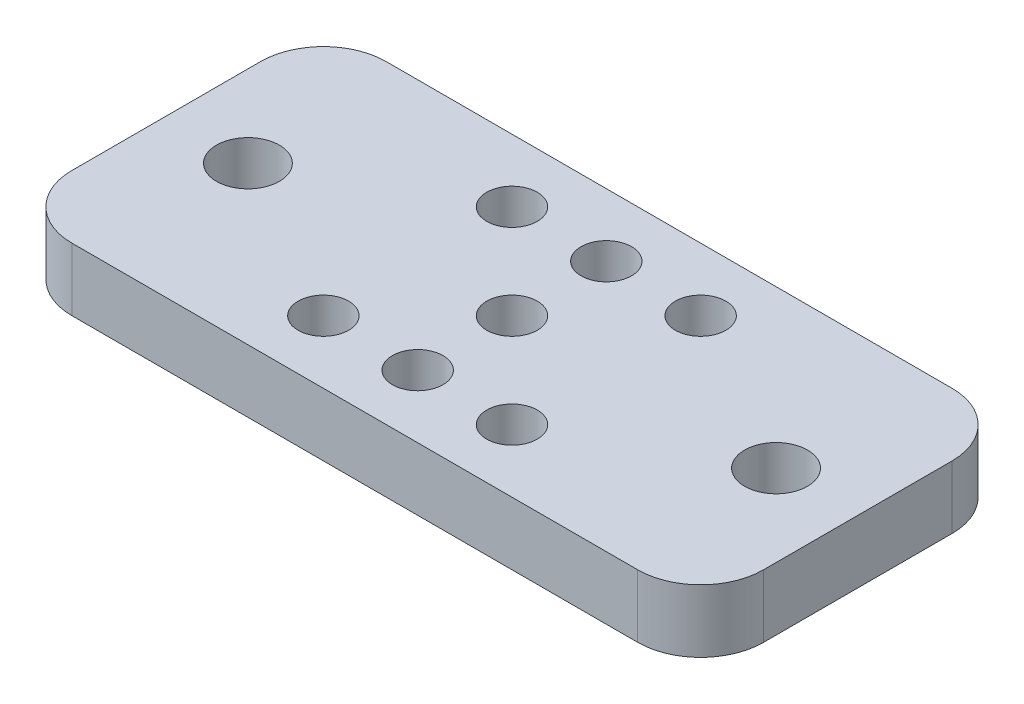
ISO-10303-21;
HEADER;
FILE_DESCRIPTION(('STEP AP214'),'2;1');
FILE_NAME('part.step','',(''),(''),'','','');
FILE_SCHEMA(('AUTOMOTIVE_DESIGN { 1 0 10303 214 1 1 1 1 }'));
ENDSEC;
DATA;
#1=APPLICATION_CONTEXT('core data for automotive mechanical design processes');
#2=APPLICATION_PROTOCOL_DEFINITION('international standard','automotive_design',2000,#1);
#3=PRODUCT_CONTEXT('',#1,'mechanical');
#4=PRODUCT('Part','Part','',(#3));
#5=PRODUCT_RELATED_PRODUCT_CATEGORY('part','',(#4));
#6=PRODUCT_DEFINITION_FORMATION('','',#4);
#7=PRODUCT_DEFINITION_CONTEXT('part definition',#1,'design');
#8=PRODUCT_DEFINITION('design','',#6,#7);
#9=PRODUCT_DEFINITION_SHAPE('','',#8);
#10=(LENGTH_UNIT() NAMED_UNIT(*) SI_UNIT(.MILLI.,.METRE.));
#11=(NAMED_UNIT(*) PLANE_ANGLE_UNIT() SI_UNIT($,.RADIAN.));
#12=(NAMED_UNIT(*) SI_UNIT($,.STERADIAN.) SOLID_ANGLE_UNIT());
#13=UNCERTAINTY_MEASURE_WITH_UNIT(LENGTH_MEASURE(1.E-05),#10,'distance_accuracy_value','');
#14=(GEOMETRIC_REPRESENTATION_CONTEXT(3) GLOBAL_UNCERTAINTY_ASSIGNED_CONTEXT((#13)) GLOBAL_UNIT_ASSIGNED_CONTEXT((#10,
#11,#12)) REPRESENTATION_CONTEXT('',''));
#15=CARTESIAN_POINT('',(0.,0.,0.));
#16=DIRECTION('',(0.,0.,1.));
#17=DIRECTION('',(1.,0.,0.));
#18=AXIS2_PLACEMENT_3D('',#15,#16,#17);
#19=CARTESIAN_POINT('',(0.,0.,0.));
#20=DIRECTION('',(0.,-1.,0.));
#21=DIRECTION('',(0.,0.,-1.));
#22=AXIS2_PLACEMENT_3D('',#19,#20,#21);
#23=CONICAL_SURFACE('',#22,4.88949999999022,0.872664625993706);
#24=CARTESIAN_POINT('',(0.,1.96080801813507,0.));
#25=DIRECTION('',(0.,-1.,0.));
#26=DIRECTION('',(0.,0.,-1.));
#27=AXIS2_PLACEMENT_3D('',#24,#25,#26);
#28=CIRCLE('',#27,2.55269999999999);
#29=CARTESIAN_POINT('',(0.,1.96080801813507,-2.55269999999999));
#30=VERTEX_POINT('',#29);
#31=EDGE_CURVE('E335',#30,#30,#28,.F.);
#32=ORIENTED_EDGE('',*,*,#31,.T.);
#33=EDGE_LOOP('',(#32));
#34=FACE_BOUND('',#33,.T.);
#35=CARTESIAN_POINT('',(0.,0.,0.));
#36=DIRECTION('',(0.,-1.,0.));
#37=DIRECTION('',(0.,0.,-1.));
#38=AXIS2_PLACEMENT_3D('',#35,#36,#37);
#39=CIRCLE('',#38,4.88949999999022);
#40=CARTESIAN_POINT('',(-1.10716033156425,-1.09044013382332E-11,-4.7625000000282));
#41=VERTEX_POINT('',#40);
#42=CARTESIAN_POINT('',(-1.1071603316559,-1.25566453852119E-11,4.76250000000612));
#43=VERTEX_POINT('',#42);
#44=EDGE_CURVE('E173',#41,#43,#39,.F.);
#45=ORIENTED_EDGE('',*,*,#44,.F.);
#46=CARTESIAN_POINT('',(-1.10716033164571,-2.63822423020211E-11,-4.76250000002541));
#47=CARTESIAN_POINT('',(-1.01556584799401,0.0174143321050501,-4.76250000002514));
#48=CARTESIAN_POINT('',(-0.923581742971783,0.0328322372802188,-4.7625000000249));
#49=CARTESIAN_POINT('',(-0.738988898880255,0.0594598202825174,-4.7625000000245));
#50=CARTESIAN_POINT('',(-0.646380037194878,0.0706686460317048,-4.76250000002433));
#51=CARTESIAN_POINT('',(-0.461577601938212,0.0885733038527393,-4.76250000002406));
#52=CARTESIAN_POINT('',(-0.369387964817245,0.0953094337230892,-4.76250000002396));
#53=CARTESIAN_POINT('',(-0.184798870483565,0.104305383924043,-4.76250000002383));
#54=CARTESIAN_POINT('',(-0.0923994352417823,0.106565653132093,-4.76250000002379));
#55=CARTESIAN_POINT('',(0.0923994352417823,0.106565653132093,-4.76250000002379));
#56=CARTESIAN_POINT('',(0.184798870483565,0.104305383924043,-4.76250000002383));
#57=CARTESIAN_POINT('',(0.369387964817244,0.0953094337230892,-4.76250000002396));
#58=CARTESIAN_POINT('',(0.461577601938212,0.0885733038527391,-4.76250000002406));
#59=CARTESIAN_POINT('',(0.646380037194877,0.070668646031705,-4.76250000002433));
#60=CARTESIAN_POINT('',(0.738988898880255,0.0594598202825179,-4.7625000000245));
#61=CARTESIAN_POINT('',(0.923581742971783,0.0328322372802197,-4.7625000000249));
#62=CARTESIAN_POINT('',(1.01556584799401,0.0174143321050511,-4.76250000002514));
#63=CARTESIAN_POINT('',(1.10716033164571,-2.63814861267324E-11,-4.76250000002541));
#64=B_SPLINE_CURVE_WITH_KNOTS('',3,(#46,#47,#48,#49,#50,#51,#52,#53,#54,#55,#56,#57,#58,#59,#60,
#61,#62,#63),.UNSPECIFIED.,.F.,.F.,(4,2,2,2,2,2,2,2,4),(0.,0.27969841270787,0.559453416538992,
0.836652406596292,1.11382359536863,1.39099478414097,1.66819377419827,1.94794877802939,
2.22764719073726),.UNSPECIFIED.);
#65=CARTESIAN_POINT('',(1.10716033156995,2.28653176471438E-12,-4.76250000001074));
#66=VERTEX_POINT('',#65);
#67=EDGE_CURVE('E168',#41,#66,#64,.T.);
#68=ORIENTED_EDGE('',*,*,#67,.T.);
#69=CARTESIAN_POINT('',(0.,0.,0.));
#70=DIRECTION('',(0.,-1.,0.));
#71=DIRECTION('',(0.,0.,-1.));
#72=AXIS2_PLACEMENT_3D('',#69,#70,#71);
#73=CIRCLE('',#72,4.88949999999022);
#74=CARTESIAN_POINT('',(1.10716033163934,-2.21943016249676E-11,4.76250000000997));
#75=VERTEX_POINT('',#74);
#76=EDGE_CURVE('E192',#75,#66,#73,.F.);
#77=ORIENTED_EDGE('',*,*,#76,.F.);
#78=CARTESIAN_POINT('',(1.1071603316573,-1.14571308680346E-11,4.76250000002176));
#79=CARTESIAN_POINT('',(1.01556584800349,0.0174143321113151,4.76250000002167));
#80=CARTESIAN_POINT('',(0.923581742980016,0.0328322372829986,4.76250000002159));
#81=CARTESIAN_POINT('',(0.738988898886656,0.0594598202828888,4.76250000002145));
#82=CARTESIAN_POINT('',(0.64638003720069,0.0706686460331491,4.76250000002139));
#83=CARTESIAN_POINT('',(0.461577601942521,0.0885733038550703,4.76250000002129));
#84=CARTESIAN_POINT('',(0.369387964820638,0.0953094337252397,4.76250000002126));
#85=CARTESIAN_POINT('',(0.184798870485221,0.104305383926103,4.76250000002121));
#86=CARTESIAN_POINT('',(0.0923994352426152,0.106565653134245,4.7625000000212));
#87=CARTESIAN_POINT('',(-0.0923994352427852,0.106565653134295,4.7625000000212));
#88=CARTESIAN_POINT('',(-0.18479887048558,0.104305383926195,4.76250000002121));
#89=CARTESIAN_POINT('',(-0.369387964821306,0.0953094337250975,4.76250000002126));
#90=CARTESIAN_POINT('',(-0.461577601943305,0.0885733038546535,4.76250000002129));
#91=CARTESIAN_POINT('',(-0.646380037201938,0.0706686460333712,4.76250000002139));
#92=CARTESIAN_POINT('',(-0.738988898888251,0.0594598202840341,4.76250000002145));
#93=CARTESIAN_POINT('',(-0.9235817429816,0.0328322372813932,4.76250000002159));
#94=CARTESIAN_POINT('',(-1.01556584800471,0.0174143321060337,4.76250000002167));
#95=CARTESIAN_POINT('',(-1.10716033165729,-2.56067399236779E-11,4.76250000002176));
#96=B_SPLINE_CURVE_WITH_KNOTS('',3,(#78,#79,#80,#81,#82,#83,#84,#85,#86,#87,#88,#89,#90,#91,#92,
#93,#94,#95),.UNSPECIFIED.,.F.,.F.,(4,2,2,2,2,2,2,2,4),(0.,0.279698412709825,0.559453416543218,
0.836652406603142,1.11382359537798,1.39099478415335,1.66819377421376,1.94794877804772,
2.2276471907583),.UNSPECIFIED.);
#97=EDGE_CURVE('E195',#75,#43,#96,.T.);
#98=ORIENTED_EDGE('',*,*,#97,.T.);
#99=EDGE_LOOP('',(#45,#68,#77,#98));
#100=FACE_BOUND('',#99,.T.);
#101=ADVANCED_FACE('F18',(#34,#100),#23,.F.);
#102=CARTESIAN_POINT('',(-9.525,5.6843418860808E-11,-9.525));
#103=DIRECTION('',(0.,-1.,0.));
#104=DIRECTION('',(0.,0.,-1.));
#105=AXIS2_PLACEMENT_3D('',#102,#103,#104);
#106=CONICAL_SURFACE('',#105,4.88949999987299,0.872664625986321);
#107=CARTESIAN_POINT('',(-9.525,1.96080801813507,-9.525));
#108=DIRECTION('',(0.,-1.,0.));
#109=DIRECTION('',(0.,0.,-1.));
#110=AXIS2_PLACEMENT_3D('',#107,#108,#109);
#111=CIRCLE('',#110,2.5527);
#112=CARTESIAN_POINT('',(-9.525,1.96080801813507,-12.0777));
#113=VERTEX_POINT('',#112);
#114=EDGE_CURVE('E337',#113,#113,#111,.F.);
#115=ORIENTED_EDGE('',*,*,#114,.T.);
#116=EDGE_LOOP('',(#115));
#117=FACE_BOUND('',#116,.T.);
#118=CARTESIAN_POINT('',(-9.525,6.16941313865913E-12,-9.525));
#119=DIRECTION('',(0.,-1.,0.));
#120=DIRECTION('',(0.,0.,-1.));
#121=AXIS2_PLACEMENT_3D('',#118,#119,#120);
#122=CIRCLE('',#121,4.88949999993338);
#123=CARTESIAN_POINT('',(-4.76250000000091,-1.91675380038478E-11,-10.6321603314985));
#124=VERTEX_POINT('',#123);
#125=CARTESIAN_POINT('',(-4.76250000003153,6.91359161869413E-12,-8.41783966849924));
#126=VERTEX_POINT('',#125);
#127=EDGE_CURVE('E150',#124,#126,#122,.F.);
#128=ORIENTED_EDGE('',*,*,#127,.F.);
#129=CARTESIAN_POINT('',(-4.7625,-4.59927771143662E-11,-10.6321603316396));
#130=CARTESIAN_POINT('',(-4.7625,0.0155579821146269,-10.5502934896204));
#131=CARTESIAN_POINT('',(-4.7625,0.0295282546617635,-10.4681299239067));
#132=CARTESIAN_POINT('',(-4.7625,0.0541269200994477,-10.3032921767551));
#133=CARTESIAN_POINT('',(-4.7625,0.0647547989670441,-10.2206179187698));
#134=CARTESIAN_POINT('',(-4.7625,0.0913695885131721,-9.97198203324816));
#135=CARTESIAN_POINT('',(-4.7625,0.102085872783814,-9.80541647975679));
#136=CARTESIAN_POINT('',(-4.7625,0.108715690096151,-9.47459587933086));
#137=CARTESIAN_POINT('',(-4.7625,0.104855890285284,-9.31034499733994));
#138=CARTESIAN_POINT('',(-4.7625,0.0830884700253322,-8.98287373706836));
#139=CARTESIAN_POINT('',(-4.7625,0.0651904806638021,-8.81965272958963));
#140=CARTESIAN_POINT('',(-4.7625,0.0347884249721777,-8.61744596602856));
#141=CARTESIAN_POINT('',(-4.7625,0.0283747411759618,-8.57747962973176));
#142=CARTESIAN_POINT('',(-4.7625,0.0147663723539465,-8.4975994598446));
#143=CARTESIAN_POINT('',(-4.7625,0.00757018111473189,-8.45768588271908));
#144=CARTESIAN_POINT('',(-4.7625,-4.59933024588265E-11,-8.41783966836035));
#145=B_SPLINE_CURVE_WITH_KNOTS('',3,(#129,#130,#131,#132,#133,#134,#135,#136,#137,#138,#139,
#140,#141,#142,#143,#144),.UNSPECIFIED.,.F.,.F.,(4,2,2,2,2,2,2,4),(0.,0.249967186429478,
0.499972796253219,1.00001199741758,1.49230753344536,1.98426561865279,2.10569518268994,
2.22736276310113),.UNSPECIFIED.);
#146=EDGE_CURVE('E22',#124,#126,#145,.T.);
#147=ORIENTED_EDGE('',*,*,#146,.T.);
#148=EDGE_LOOP('',(#128,#147));
#149=FACE_BOUND('',#148,.T.);
#150=ADVANCED_FACE('F165',(#117,#149),#106,.F.);
#151=CARTESIAN_POINT('',(9.525,5.6843418860808E-11,-9.525));
#152=DIRECTION('',(0.,-1.,0.));
#153=DIRECTION('',(0.,0.,-1.));
#154=AXIS2_PLACEMENT_3D('',#151,#152,#153);
#155=CONICAL_SURFACE('',#154,4.88949999987299,0.872664625986321);
#156=CARTESIAN_POINT('',(9.525,1.96080801813507,-9.525));
#157=DIRECTION('',(0.,-1.,0.));
#158=DIRECTION('',(0.,0.,-1.));
#159=AXIS2_PLACEMENT_3D('',#156,#157,#158);
#160=CIRCLE('',#159,2.5527);
#161=CARTESIAN_POINT('',(9.525,1.96080801813507,-12.0777));
#162=VERTEX_POINT('',#161);
#163=EDGE_CURVE('E343',#162,#162,#160,.F.);
#164=ORIENTED_EDGE('',*,*,#163,.T.);
#165=EDGE_LOOP('',(#164));
#166=FACE_BOUND('',#165,.T.);
#167=CARTESIAN_POINT('',(9.525,6.16941313865913E-12,-9.525));
#168=DIRECTION('',(0.,-1.,0.));
#169=DIRECTION('',(0.,0.,-1.));
#170=AXIS2_PLACEMENT_3D('',#167,#168,#169);
#171=CIRCLE('',#170,4.88949999993338);
#172=CARTESIAN_POINT('',(4.7625,-1.84030050918551E-11,-8.41783966850557));
#173=VERTEX_POINT('',#172);
#174=CARTESIAN_POINT('',(4.76250000003153,6.91359161869413E-12,-10.6321603315008));
#175=VERTEX_POINT('',#174);
#176=EDGE_CURVE('E185',#173,#175,#171,.F.);
#177=ORIENTED_EDGE('',*,*,#176,.F.);
#178=CARTESIAN_POINT('',(4.7625,-4.59516161358119E-11,-8.41783966836058));
#179=CARTESIAN_POINT('',(4.7625,0.0155579821146646,-8.49970651037986));
#180=CARTESIAN_POINT('',(4.7625,0.0295282546617979,-8.58187007609351));
#181=CARTESIAN_POINT('',(4.7625,0.0541269200994759,-8.74670782324512));
#182=CARTESIAN_POINT('',(4.7625,0.0647547989670691,-8.82938208123037));
#183=CARTESIAN_POINT('',(4.7625,0.0913695885131876,-9.07801796675206));
#184=CARTESIAN_POINT('',(4.7625,0.102085872783823,-9.24458352024342));
#185=CARTESIAN_POINT('',(4.7625,0.108715690096147,-9.57540412066935));
#186=CARTESIAN_POINT('',(4.7625,0.104855890285275,-9.73965500266026));
#187=CARTESIAN_POINT('',(4.7625,0.083088470025312,-10.0671262629318));
#188=CARTESIAN_POINT('',(4.7625,0.0651904806637762,-10.2303472704106));
#189=CARTESIAN_POINT('',(4.7625,0.0347884249721518,-10.4325540339716));
#190=CARTESIAN_POINT('',(4.7625,0.0283747411759406,-10.4725203702684));
#191=CARTESIAN_POINT('',(4.7625,0.0147663723539357,-10.5524005401555));
#192=CARTESIAN_POINT('',(4.7625,0.00757018111472671,-10.5923141172809));
#193=CARTESIAN_POINT('',(4.7625,-4.59925801199573E-11,-10.6321603316396));
#194=B_SPLINE_CURVE_WITH_KNOTS('',3,(#178,#179,#180,#181,#182,#183,#184,#185,#186,#187,#188,
#189,#190,#191,#192,#193),.UNSPECIFIED.,.F.,.F.,(4,2,2,2,2,2,2,4),(0.,0.249967186429472,
0.499972796253209,1.00001199741756,1.49230753344533,1.98426561865275,2.1056951826898,
2.22736276310089),.UNSPECIFIED.);
#195=EDGE_CURVE('E225',#173,#175,#194,.T.);
#196=ORIENTED_EDGE('',*,*,#195,.T.);
#197=EDGE_LOOP('',(#177,#196));
#198=FACE_BOUND('',#197,.T.);
#199=ADVANCED_FACE('F237',(#166,#198),#155,.F.);
#200=CARTESIAN_POINT('',(9.525,5.6843418860808E-11,9.525));
#201=DIRECTION('',(0.,-1.,0.));
#202=DIRECTION('',(0.,0.,-1.));
#203=AXIS2_PLACEMENT_3D('',#200,#201,#202);
#204=CONICAL_SURFACE('',#203,4.88949999988008,0.872664625993706);
#205=CARTESIAN_POINT('',(9.525,1.96080801813507,9.525));
#206=DIRECTION('',(0.,-1.,0.));
#207=DIRECTION('',(0.,0.,-1.));
#208=AXIS2_PLACEMENT_3D('',#205,#206,#207);
#209=CIRCLE('',#208,2.5527);
#210=CARTESIAN_POINT('',(9.525,1.96080801813507,6.9723));
#211=VERTEX_POINT('',#210);
#212=EDGE_CURVE('E453',#211,#211,#209,.F.);
#213=ORIENTED_EDGE('',*,*,#212,.T.);
#214=EDGE_LOOP('',(#213));
#215=FACE_BOUND('',#214,.T.);
#216=CARTESIAN_POINT('',(9.525,-3.55729952158583E-11,9.525));
#217=DIRECTION('',(0.,-1.,0.));
#218=DIRECTION('',(0.,0.,-1.));
#219=AXIS2_PLACEMENT_3D('',#216,#217,#218);
#220=CIRCLE('',#219,4.88949999999022);
#221=CARTESIAN_POINT('',(4.76249999999909,-3.97749298917532E-11,10.6321603316383));
#222=VERTEX_POINT('',#221);
#223=CARTESIAN_POINT('',(4.76250000000568,-3.63175375973388E-11,8.41783966835945));
#224=VERTEX_POINT('',#223);
#225=EDGE_CURVE('E346',#222,#224,#220,.F.);
#226=ORIENTED_EDGE('',*,*,#225,.F.);
#227=CARTESIAN_POINT('',(4.7625,-4.24871205896211E-11,10.6321603316525));
#228=CARTESIAN_POINT('',(4.7625,0.0155579821183182,10.550293489632));
#229=CARTESIAN_POINT('',(4.7625,0.0295282546656159,10.468129923917));
#230=CARTESIAN_POINT('',(4.7625,0.0541269201035695,10.3032921767628));
#231=CARTESIAN_POINT('',(4.7625,0.0647547989712738,10.2206179187762));
#232=CARTESIAN_POINT('',(4.7625,0.0913695885176391,9.97198203325059));
#233=CARTESIAN_POINT('',(4.7625,0.102085872788324,9.8054164797566));
#234=CARTESIAN_POINT('',(4.7625,0.108715690100502,9.47459587932545));
#235=CARTESIAN_POINT('',(4.7625,0.104855890289436,9.31034499733194));
#236=CARTESIAN_POINT('',(4.7625,0.083088470028864,8.9828737370552));
#237=CARTESIAN_POINT('',(4.7625,0.065190480666913,8.81965272957392));
#238=CARTESIAN_POINT('',(4.7625,0.034788424974878,8.61744596601121));
#239=CARTESIAN_POINT('',(4.7625,0.0283747411787897,8.57747962971531));
#240=CARTESIAN_POINT('',(4.7625,0.0147663723570777,8.49759945982994));
#241=CARTESIAN_POINT('',(4.7625,0.00757018111803902,8.45768588270531));
#242=CARTESIAN_POINT('',(4.7625,-4.24871089386608E-11,8.41783966834747));
#243=B_SPLINE_CURVE_WITH_KNOTS('',3,(#227,#228,#229,#230,#231,#232,#233,#234,#235,#236,#237,
#238,#239,#240,#241,#242),.UNSPECIFIED.,.F.,.F.,(4,2,2,2,2,2,2,4),(0.,0.24996718643341,
0.499972796261085,1.00001199743331,1.49230753346886,1.98426561868406,2.10569518271849,
2.22736276312695),.UNSPECIFIED.);
#244=EDGE_CURVE('E202',#222,#224,#243,.T.);
#245=ORIENTED_EDGE('',*,*,#244,.T.);
#246=EDGE_LOOP('',(#226,#245));
#247=FACE_BOUND('',#246,.T.);
#248=ADVANCED_FACE('F233',(#215,#247),#204,.F.);
#249=CARTESIAN_POINT('',(-9.525,5.6843418860808E-11,9.525));
#250=DIRECTION('',(0.,-1.,0.));
#251=DIRECTION('',(0.,0.,-1.));
#252=AXIS2_PLACEMENT_3D('',#249,#250,#251);
#253=CONICAL_SURFACE('',#252,4.88949999988008,0.872664625993706);
#254=CARTESIAN_POINT('',(-9.525,1.96080801813507,9.525));
#255=DIRECTION('',(0.,-1.,0.));
#256=DIRECTION('',(0.,0.,-1.));
#257=AXIS2_PLACEMENT_3D('',#254,#255,#256);
#258=CIRCLE('',#257,2.5527);
#259=CARTESIAN_POINT('',(-9.525,1.96080801813507,6.9723));
#260=VERTEX_POINT('',#259);
#261=EDGE_CURVE('E455',#260,#260,#258,.F.);
#262=ORIENTED_EDGE('',*,*,#261,.T.);
#263=EDGE_LOOP('',(#262));
#264=FACE_BOUND('',#263,.T.);
#265=CARTESIAN_POINT('',(-9.525,-3.55744508216872E-11,9.525));
#266=DIRECTION('',(0.,-1.,0.));
#267=DIRECTION('',(0.,0.,-1.));
#268=AXIS2_PLACEMENT_3D('',#265,#266,#267);
#269=CIRCLE('',#268,4.88949999999022);
#270=CARTESIAN_POINT('',(-4.7625,-4.05403636950191E-11,8.41783966835772));
#271=VERTEX_POINT('',#270);
#272=CARTESIAN_POINT('',(-4.76250000000567,-3.63186293017105E-11,10.6321603316405));
#273=VERTEX_POINT('',#272);
#274=EDGE_CURVE('E435',#271,#273,#269,.F.);
#275=ORIENTED_EDGE('',*,*,#274,.F.);
#276=CARTESIAN_POINT('',(-4.7625,-4.25293521401065E-11,8.41783966834725));
#277=CARTESIAN_POINT('',(-4.7625,0.0155579821182793,8.49970651036783));
#278=CARTESIAN_POINT('',(-4.7625,0.0295282546655801,8.58187007608279));
#279=CARTESIAN_POINT('',(-4.7625,0.0541269201035399,8.74670782323702));
#280=CARTESIAN_POINT('',(-4.7625,0.0647547989712474,8.82938208122359));
#281=CARTESIAN_POINT('',(-4.7625,0.0913695885176218,9.07801796674921));
#282=CARTESIAN_POINT('',(-4.7625,0.102085872788313,9.2445835202432));
#283=CARTESIAN_POINT('',(-4.7625,0.108715690100503,9.57540412067436));
#284=CARTESIAN_POINT('',(-4.7625,0.104855890289442,9.73965500266787));
#285=CARTESIAN_POINT('',(-4.7625,0.0830884700288797,10.0671262629446));
#286=CARTESIAN_POINT('',(-4.7625,0.0651904806669328,10.2303472704259));
#287=CARTESIAN_POINT('',(-4.7625,0.0347884249749001,10.4325540339886));
#288=CARTESIAN_POINT('',(-4.7625,0.0283747411788084,10.4725203702846));
#289=CARTESIAN_POINT('',(-4.7625,0.0147663723570881,10.55240054017));
#290=CARTESIAN_POINT('',(-4.7625,0.00757018111804455,10.5923141172947));
#291=CARTESIAN_POINT('',(-4.7625,-4.24874784491326E-11,10.6321603316525));
#292=B_SPLINE_CURVE_WITH_KNOTS('',3,(#276,#277,#278,#279,#280,#281,#282,#283,#284,#285,#286,
#287,#288,#289,#290,#291),.UNSPECIFIED.,.F.,.F.,(4,2,2,2,2,2,2,4),(0.,0.249967186433415,
0.499972796261098,1.00001199743333,1.4923075334689,1.9842656186841,2.10569518271862,
2.22736276312717),.UNSPECIFIED.);
#293=EDGE_CURVE('E218',#271,#273,#292,.T.);
#294=ORIENTED_EDGE('',*,*,#293,.T.);
#295=EDGE_LOOP('',(#275,#294));
#296=FACE_BOUND('',#295,.T.);
#297=ADVANCED_FACE('F230',(#264,#296),#253,.F.);
#298=CARTESIAN_POINT('',(0.,5.6843418860808E-11,-9.525));
#299=DIRECTION('',(0.,-1.,0.));
#300=DIRECTION('',(0.,0.,-1.));
#301=AXIS2_PLACEMENT_3D('',#298,#299,#300);
#302=CONICAL_SURFACE('',#301,4.88949999987299,0.872664625986321);
#303=CARTESIAN_POINT('',(0.,1.96080801813507,-9.525));
#304=DIRECTION('',(0.,-1.,0.));
#305=DIRECTION('',(0.,0.,-1.));
#306=AXIS2_PLACEMENT_3D('',#303,#304,#305);
#307=CIRCLE('',#306,2.5527);
#308=CARTESIAN_POINT('',(0.,1.96080801813507,-12.0777));
#309=VERTEX_POINT('',#308);
#310=EDGE_CURVE('E466',#309,#309,#307,.F.);
#311=ORIENTED_EDGE('',*,*,#310,.T.);
#312=EDGE_LOOP('',(#311));
#313=FACE_BOUND('',#312,.T.);
#314=CARTESIAN_POINT('',(0.,6.16941313865913E-12,-9.525));
#315=DIRECTION('',(0.,-1.,0.));
#316=DIRECTION('',(0.,0.,-1.));
#317=AXIS2_PLACEMENT_3D('',#314,#315,#316);
#318=CIRCLE('',#317,4.88949999993338);
#319=EDGE_CURVE('E162',#175,#124,#318,.F.);
#320=ORIENTED_EDGE('',*,*,#319,.F.);
#321=ORIENTED_EDGE('',*,*,#195,.F.);
#322=CARTESIAN_POINT('',(0.,9.146127058798E-12,-9.525));
#323=DIRECTION('',(0.,-1.,0.));
#324=DIRECTION('',(0.,0.,-1.));
#325=AXIS2_PLACEMENT_3D('',#322,#323,#324);
#326=CIRCLE('',#325,4.88949999992983);
#327=EDGE_CURVE('E188',#66,#173,#326,.F.);
#328=ORIENTED_EDGE('',*,*,#327,.F.);
#329=ORIENTED_EDGE('',*,*,#67,.F.);
#330=CARTESIAN_POINT('',(0.,9.146127058798E-12,-9.525));
#331=DIRECTION('',(0.,-1.,0.));
#332=DIRECTION('',(0.,0.,-1.));
#333=AXIS2_PLACEMENT_3D('',#330,#331,#332);
#334=CIRCLE('',#333,4.88949999992983);
#335=EDGE_CURVE('E159',#126,#41,#334,.F.);
#336=ORIENTED_EDGE('',*,*,#335,.F.);
#337=ORIENTED_EDGE('',*,*,#146,.F.);
#338=EDGE_LOOP('',(#320,#321,#328,#329,#336,#337));
#339=FACE_BOUND('',#338,.T.);
#340=ADVANCED_FACE('F169',(#313,#339),#302,.F.);
#341=CARTESIAN_POINT('',(0.,5.6843418860808E-11,9.525));
#342=DIRECTION('',(0.,-1.,0.));
#343=DIRECTION('',(0.,0.,-1.));
#344=AXIS2_PLACEMENT_3D('',#341,#342,#343);
#345=CONICAL_SURFACE('',#344,4.88949999988008,0.872664625993706);
#346=CARTESIAN_POINT('',(0.,1.96080801813507,9.525));
#347=DIRECTION('',(0.,-1.,0.));
#348=DIRECTION('',(0.,0.,-1.));
#349=AXIS2_PLACEMENT_3D('',#346,#347,#348);
#350=CIRCLE('',#349,2.5527);
#351=CARTESIAN_POINT('',(0.,1.96080801813507,6.9723));
#352=VERTEX_POINT('',#351);
#353=EDGE_CURVE('E427',#352,#352,#350,.F.);
#354=ORIENTED_EDGE('',*,*,#353,.T.);
#355=EDGE_LOOP('',(#354));
#356=FACE_BOUND('',#355,.T.);
#357=CARTESIAN_POINT('',(0.,-3.85511647417814E-11,9.525));
#358=DIRECTION('',(0.,-1.,0.));
#359=DIRECTION('',(0.,0.,-1.));
#360=AXIS2_PLACEMENT_3D('',#357,#358,#359);
#361=CIRCLE('',#360,4.88949999999377);
#362=EDGE_CURVE('E179',#43,#271,#361,.F.);
#363=ORIENTED_EDGE('',*,*,#362,.F.);
#364=ORIENTED_EDGE('',*,*,#97,.F.);
#365=CARTESIAN_POINT('',(0.,-3.85511647417814E-11,9.525));
#366=DIRECTION('',(0.,-1.,0.));
#367=DIRECTION('',(0.,0.,-1.));
#368=AXIS2_PLACEMENT_3D('',#365,#366,#367);
#369=CIRCLE('',#368,4.88949999999377);
#370=EDGE_CURVE('E338',#224,#75,#369,.F.);
#371=ORIENTED_EDGE('',*,*,#370,.F.);
#372=ORIENTED_EDGE('',*,*,#244,.F.);
#373=CARTESIAN_POINT('',(0.,-3.55744508216872E-11,9.525));
#374=DIRECTION('',(0.,-1.,0.));
#375=DIRECTION('',(0.,0.,-1.));
#376=AXIS2_PLACEMENT_3D('',#373,#374,#375);
#377=CIRCLE('',#376,4.88949999999022);
#378=EDGE_CURVE('E431',#273,#222,#377,.F.);
#379=ORIENTED_EDGE('',*,*,#378,.F.);
#380=ORIENTED_EDGE('',*,*,#293,.F.);
#381=EDGE_LOOP('',(#363,#364,#371,#372,#379,#380));
#382=FACE_BOUND('',#381,.T.);
#383=ADVANCED_FACE('F208',(#356,#382),#345,.F.);
#384=CARTESIAN_POINT('',(0.,0.,0.));
#385=DIRECTION('',(0.,-1.,0.));
#386=DIRECTION('',(0.,0.,-1.));
#387=AXIS2_PLACEMENT_3D('',#384,#385,#386);
#388=PLANE('',#387);
#389=DIRECTION('',(0.,0.,1.));
#390=VECTOR('',#389,1.);
#391=CARTESIAN_POINT('',(34.925,0.,-15.875));
#392=LINE('',#391,#390);
#393=CARTESIAN_POINT('',(34.925,0.,-9.525));
#394=VERTEX_POINT('',#393);
#395=CARTESIAN_POINT('',(34.925,0.,9.525));
#396=VERTEX_POINT('',#395);
#397=EDGE_CURVE('E410',#394,#396,#392,.T.);
#398=ORIENTED_EDGE('',*,*,#397,.T.);
#399=CARTESIAN_POINT('',(28.575,0.,9.525));
#400=DIRECTION('',(0.,-1.,0.));
#401=DIRECTION('',(0.,0.,-1.));
#402=AXIS2_PLACEMENT_3D('',#399,#400,#401);
#403=CIRCLE('',#402,6.35);
#404=CARTESIAN_POINT('',(28.575,0.,15.875));
#405=VERTEX_POINT('',#404);
#406=EDGE_CURVE('E406',#405,#396,#403,.F.);
#407=ORIENTED_EDGE('',*,*,#406,.F.);
#408=DIRECTION('',(-1.,0.,0.));
#409=VECTOR('',#408,1.);
#410=CARTESIAN_POINT('',(34.925,0.,15.875));
#411=LINE('',#410,#409);
#412=CARTESIAN_POINT('',(-28.575,0.,15.875));
#413=VERTEX_POINT('',#412);
#414=EDGE_CURVE('E405',#405,#413,#411,.T.);
#415=ORIENTED_EDGE('',*,*,#414,.T.);
#416=CARTESIAN_POINT('',(-28.575,0.,9.52500000000001));
#417=DIRECTION('',(0.,-1.,0.));
#418=DIRECTION('',(0.,0.,-1.));
#419=AXIS2_PLACEMENT_3D('',#416,#417,#418);
#420=CIRCLE('',#419,6.35);
#421=CARTESIAN_POINT('',(-34.925,0.,9.52500000000001));
#422=VERTEX_POINT('',#421);
#423=EDGE_CURVE('E401',#422,#413,#420,.F.);
#424=ORIENTED_EDGE('',*,*,#423,.F.);
#425=DIRECTION('',(0.,0.,-1.));
#426=VECTOR('',#425,1.);
#427=CARTESIAN_POINT('',(-34.925,0.,-15.875));
#428=LINE('',#427,#426);
#429=CARTESIAN_POINT('',(-34.925,0.,-9.525));
#430=VERTEX_POINT('',#429);
#431=EDGE_CURVE('E400',#422,#430,#428,.T.);
#432=ORIENTED_EDGE('',*,*,#431,.T.);
#433=CARTESIAN_POINT('',(-28.575,0.,-9.525));
#434=DIRECTION('',(0.,-1.,0.));
#435=DIRECTION('',(0.,0.,-1.));
#436=AXIS2_PLACEMENT_3D('',#433,#434,#435);
#437=CIRCLE('',#436,6.35);
#438=CARTESIAN_POINT('',(-28.575,0.,-15.875));
#439=VERTEX_POINT('',#438);
#440=EDGE_CURVE('E416',#439,#430,#437,.F.);
#441=ORIENTED_EDGE('',*,*,#440,.F.);
#442=DIRECTION('',(1.,0.,0.));
#443=VECTOR('',#442,1.);
#444=CARTESIAN_POINT('',(34.925,0.,-15.875));
#445=LINE('',#444,#443);
#446=CARTESIAN_POINT('',(28.575,0.,-15.875));
#447=VERTEX_POINT('',#446);
#448=EDGE_CURVE('E415',#439,#447,#445,.T.);
#449=ORIENTED_EDGE('',*,*,#448,.T.);
#450=CARTESIAN_POINT('',(28.575,0.,-9.525));
#451=DIRECTION('',(0.,-1.,0.));
#452=DIRECTION('',(0.,0.,-1.));
#453=AXIS2_PLACEMENT_3D('',#450,#451,#452);
#454=CIRCLE('',#453,6.35);
#455=EDGE_CURVE('E411',#394,#447,#454,.F.);
#456=ORIENTED_EDGE('',*,*,#455,.F.);
#457=EDGE_LOOP('',(#398,#407,#415,#424,#432,#441,#449,#456));
#458=FACE_BOUND('',#457,.T.);
#459=CARTESIAN_POINT('',(-26.67,0.,0.));
#460=DIRECTION('',(0.,1.,0.));
#461=DIRECTION('',(0.,0.,1.));
#462=AXIS2_PLACEMENT_3D('',#459,#460,#461);
#463=CIRCLE('',#462,3.175);
#464=CARTESIAN_POINT('',(-26.67,0.,3.17500000000001));
#465=VERTEX_POINT('',#464);
#466=EDGE_CURVE('E420',#465,#465,#463,.T.);
#467=ORIENTED_EDGE('',*,*,#466,.T.);
#468=EDGE_LOOP('',(#467));
#469=FACE_BOUND('',#468,.T.);
#470=CARTESIAN_POINT('',(26.67,0.,0.));
#471=DIRECTION('',(0.,1.,0.));
#472=DIRECTION('',(0.,0.,1.));
#473=AXIS2_PLACEMENT_3D('',#470,#471,#472);
#474=CIRCLE('',#473,3.175);
#475=CARTESIAN_POINT('',(26.67,0.,3.17500000000001));
#476=VERTEX_POINT('',#475);
#477=EDGE_CURVE('E424',#476,#476,#474,.T.);
#478=ORIENTED_EDGE('',*,*,#477,.T.);
#479=EDGE_LOOP('',(#478));
#480=FACE_BOUND('',#479,.T.);
#481=ORIENTED_EDGE('',*,*,#225,.T.);
#482=ORIENTED_EDGE('',*,*,#370,.T.);
#483=ORIENTED_EDGE('',*,*,#76,.T.);
#484=ORIENTED_EDGE('',*,*,#327,.T.);
#485=ORIENTED_EDGE('',*,*,#176,.T.);
#486=ORIENTED_EDGE('',*,*,#319,.T.);
#487=ORIENTED_EDGE('',*,*,#127,.T.);
#488=ORIENTED_EDGE('',*,*,#335,.T.);
#489=ORIENTED_EDGE('',*,*,#44,.T.);
#490=ORIENTED_EDGE('',*,*,#362,.T.);
#491=ORIENTED_EDGE('',*,*,#274,.T.);
#492=ORIENTED_EDGE('',*,*,#378,.T.);
#493=EDGE_LOOP('',(#481,#482,#483,#484,#485,#486,#487,#488,#489,#490,#491,#492));
#494=FACE_BOUND('',#493,.T.);
#495=ADVANCED_FACE('F156',(#458,#469,#480,#494),#388,.T.);
#496=CARTESIAN_POINT('',(0.,0.,0.));
#497=DIRECTION('',(0.,-1.,0.));
#498=DIRECTION('',(0.,0.,-1.));
#499=AXIS2_PLACEMENT_3D('',#496,#497,#498);
#500=CYLINDRICAL_SURFACE('',#499,2.55269999999999);
#501=CARTESIAN_POINT('',(0.,6.34999999999999,0.));
#502=DIRECTION('',(0.,-1.,0.));
#503=DIRECTION('',(0.,0.,-1.));
#504=AXIS2_PLACEMENT_3D('',#501,#502,#503);
#505=CIRCLE('',#504,2.55269999999999);
#506=CARTESIAN_POINT('',(0.,6.34999999999999,-2.55269999999999));
#507=VERTEX_POINT('',#506);
#508=EDGE_CURVE('E332',#507,#507,#505,.F.);
#509=ORIENTED_EDGE('',*,*,#508,.T.);
#510=EDGE_LOOP('',(#509));
#511=FACE_BOUND('',#510,.T.);
#512=ORIENTED_EDGE('',*,*,#31,.F.);
#513=EDGE_LOOP('',(#512));
#514=FACE_BOUND('',#513,.T.);
#515=ADVANCED_FACE('F321',(#511,#514),#500,.F.);
#516=CARTESIAN_POINT('',(-9.525,0.,-9.525));
#517=DIRECTION('',(0.,-1.,0.));
#518=DIRECTION('',(0.,0.,-1.));
#519=AXIS2_PLACEMENT_3D('',#516,#517,#518);
#520=CYLINDRICAL_SURFACE('',#519,2.5527);
#521=CARTESIAN_POINT('',(-9.525,6.35,-9.525));
#522=DIRECTION('',(0.,-1.,0.));
#523=DIRECTION('',(0.,0.,-1.));
#524=AXIS2_PLACEMENT_3D('',#521,#522,#523);
#525=CIRCLE('',#524,2.5527);
#526=CARTESIAN_POINT('',(-9.525,6.35,-12.0777));
#527=VERTEX_POINT('',#526);
#528=EDGE_CURVE('E395',#527,#527,#525,.F.);
#529=ORIENTED_EDGE('',*,*,#528,.T.);
#530=EDGE_LOOP('',(#529));
#531=FACE_BOUND('',#530,.T.);
#532=ORIENTED_EDGE('',*,*,#114,.F.);
#533=EDGE_LOOP('',(#532));
#534=FACE_BOUND('',#533,.T.);
#535=ADVANCED_FACE('F318',(#531,#534),#520,.F.);
#536=CARTESIAN_POINT('',(9.525,0.,-9.525));
#537=DIRECTION('',(0.,-1.,0.));
#538=DIRECTION('',(0.,0.,-1.));
#539=AXIS2_PLACEMENT_3D('',#536,#537,#538);
#540=CYLINDRICAL_SURFACE('',#539,2.5527);
#541=CARTESIAN_POINT('',(9.525,6.35,-9.525));
#542=DIRECTION('',(0.,-1.,0.));
#543=DIRECTION('',(0.,0.,-1.));
#544=AXIS2_PLACEMENT_3D('',#541,#542,#543);
#545=CIRCLE('',#544,2.5527);
#546=CARTESIAN_POINT('',(9.525,6.35,-12.0777));
#547=VERTEX_POINT('',#546);
#548=EDGE_CURVE('E391',#547,#547,#545,.F.);
#549=ORIENTED_EDGE('',*,*,#548,.T.);
#550=EDGE_LOOP('',(#549));
#551=FACE_BOUND('',#550,.T.);
#552=ORIENTED_EDGE('',*,*,#163,.F.);
#553=EDGE_LOOP('',(#552));
#554=FACE_BOUND('',#553,.T.);
#555=ADVANCED_FACE('F314',(#551,#554),#540,.F.);
#556=CARTESIAN_POINT('',(9.525,0.,9.525));
#557=DIRECTION('',(0.,-1.,0.));
#558=DIRECTION('',(0.,0.,-1.));
#559=AXIS2_PLACEMENT_3D('',#556,#557,#558);
#560=CYLINDRICAL_SURFACE('',#559,2.5527);
#561=CARTESIAN_POINT('',(9.525,6.35,9.525));
#562=DIRECTION('',(0.,-1.,0.));
#563=DIRECTION('',(0.,0.,-1.));
#564=AXIS2_PLACEMENT_3D('',#561,#562,#563);
#565=CIRCLE('',#564,2.5527);
#566=CARTESIAN_POINT('',(9.525,6.35,6.9723));
#567=VERTEX_POINT('',#566);
#568=EDGE_CURVE('E387',#567,#567,#565,.F.);
#569=ORIENTED_EDGE('',*,*,#568,.T.);
#570=EDGE_LOOP('',(#569));
#571=FACE_BOUND('',#570,.T.);
#572=ORIENTED_EDGE('',*,*,#212,.F.);
#573=EDGE_LOOP('',(#572));
#574=FACE_BOUND('',#573,.T.);
#575=ADVANCED_FACE('F310',(#571,#574),#560,.F.);
#576=CARTESIAN_POINT('',(-9.525,0.,9.525));
#577=DIRECTION('',(0.,-1.,0.));
#578=DIRECTION('',(0.,0.,-1.));
#579=AXIS2_PLACEMENT_3D('',#576,#577,#578);
#580=CYLINDRICAL_SURFACE('',#579,2.5527);
#581=CARTESIAN_POINT('',(-9.525,6.35,9.525));
#582=DIRECTION('',(0.,-1.,0.));
#583=DIRECTION('',(0.,0.,-1.));
#584=AXIS2_PLACEMENT_3D('',#581,#582,#583);
#585=CIRCLE('',#584,2.5527);
#586=CARTESIAN_POINT('',(-9.525,6.35,6.9723));
#587=VERTEX_POINT('',#586);
#588=EDGE_CURVE('E383',#587,#587,#585,.F.);
#589=ORIENTED_EDGE('',*,*,#588,.T.);
#590=EDGE_LOOP('',(#589));
#591=FACE_BOUND('',#590,.T.);
#592=ORIENTED_EDGE('',*,*,#261,.F.);
#593=EDGE_LOOP('',(#592));
#594=FACE_BOUND('',#593,.T.);
#595=ADVANCED_FACE('F306',(#591,#594),#580,.F.);
#596=CARTESIAN_POINT('',(0.,0.,-9.525));
#597=DIRECTION('',(0.,-1.,0.));
#598=DIRECTION('',(0.,0.,-1.));
#599=AXIS2_PLACEMENT_3D('',#596,#597,#598);
#600=CYLINDRICAL_SURFACE('',#599,2.5527);
#601=CARTESIAN_POINT('',(0.,6.35,-9.525));
#602=DIRECTION('',(0.,-1.,0.));
#603=DIRECTION('',(0.,0.,-1.));
#604=AXIS2_PLACEMENT_3D('',#601,#602,#603);
#605=CIRCLE('',#604,2.5527);
#606=CARTESIAN_POINT('',(0.,6.35,-12.0777));
#607=VERTEX_POINT('',#606);
#608=EDGE_CURVE('E380',#607,#607,#605,.F.);
#609=ORIENTED_EDGE('',*,*,#608,.T.);
#610=EDGE_LOOP('',(#609));
#611=FACE_BOUND('',#610,.T.);
#612=ORIENTED_EDGE('',*,*,#310,.F.);
#613=EDGE_LOOP('',(#612));
#614=FACE_BOUND('',#613,.T.);
#615=ADVANCED_FACE('F302',(#611,#614),#600,.F.);
#616=CARTESIAN_POINT('',(0.,0.,9.525));
#617=DIRECTION('',(0.,-1.,0.));
#618=DIRECTION('',(0.,0.,-1.));
#619=AXIS2_PLACEMENT_3D('',#616,#617,#618);
#620=CYLINDRICAL_SURFACE('',#619,2.5527);
#621=CARTESIAN_POINT('',(0.,6.35,9.525));
#622=DIRECTION('',(0.,-1.,0.));
#623=DIRECTION('',(0.,0.,-1.));
#624=AXIS2_PLACEMENT_3D('',#621,#622,#623);
#625=CIRCLE('',#624,2.5527);
#626=CARTESIAN_POINT('',(0.,6.35,6.9723));
#627=VERTEX_POINT('',#626);
#628=EDGE_CURVE('E376',#627,#627,#625,.F.);
#629=ORIENTED_EDGE('',*,*,#628,.T.);
#630=EDGE_LOOP('',(#629));
#631=FACE_BOUND('',#630,.T.);
#632=ORIENTED_EDGE('',*,*,#353,.F.);
#633=EDGE_LOOP('',(#632));
#634=FACE_BOUND('',#633,.T.);
#635=ADVANCED_FACE('F298',(#631,#634),#620,.F.);
#636=CARTESIAN_POINT('',(26.67,0.,0.));
#637=DIRECTION('',(0.,1.,0.));
#638=DIRECTION('',(0.,0.,1.));
#639=AXIS2_PLACEMENT_3D('',#636,#637,#638);
#640=CYLINDRICAL_SURFACE('',#639,3.175);
#641=ORIENTED_EDGE('',*,*,#477,.F.);
#642=EDGE_LOOP('',(#641));
#643=FACE_BOUND('',#642,.T.);
#644=CARTESIAN_POINT('',(26.67,6.35,0.));
#645=DIRECTION('',(0.,1.,0.));
#646=DIRECTION('',(0.,0.,1.));
#647=AXIS2_PLACEMENT_3D('',#644,#645,#646);
#648=CIRCLE('',#647,3.175);
#649=CARTESIAN_POINT('',(26.67,6.35,3.17500000000001));
#650=VERTEX_POINT('',#649);
#651=EDGE_CURVE('E372',#650,#650,#648,.T.);
#652=ORIENTED_EDGE('',*,*,#651,.T.);
#653=EDGE_LOOP('',(#652));
#654=FACE_BOUND('',#653,.T.);
#655=ADVANCED_FACE('F294',(#643,#654),#640,.F.);
#656=CARTESIAN_POINT('',(-26.67,0.,0.));
#657=DIRECTION('',(0.,1.,0.));
#658=DIRECTION('',(0.,0.,1.));
#659=AXIS2_PLACEMENT_3D('',#656,#657,#658);
#660=CYLINDRICAL_SURFACE('',#659,3.175);
#661=ORIENTED_EDGE('',*,*,#466,.F.);
#662=EDGE_LOOP('',(#661));
#663=FACE_BOUND('',#662,.T.);
#664=CARTESIAN_POINT('',(-26.67,6.35,0.));
#665=DIRECTION('',(0.,1.,0.));
#666=DIRECTION('',(0.,0.,1.));
#667=AXIS2_PLACEMENT_3D('',#664,#665,#666);
#668=CIRCLE('',#667,3.175);
#669=CARTESIAN_POINT('',(-26.67,6.35,3.17500000000001));
#670=VERTEX_POINT('',#669);
#671=EDGE_CURVE('E368',#670,#670,#668,.T.);
#672=ORIENTED_EDGE('',*,*,#671,.T.);
#673=EDGE_LOOP('',(#672));
#674=FACE_BOUND('',#673,.T.);
#675=ADVANCED_FACE('F290',(#663,#674),#660,.F.);
#676=CARTESIAN_POINT('',(-28.575,6.35,-9.525));
#677=DIRECTION('',(0.,-1.,0.));
#678=DIRECTION('',(0.,0.,-1.));
#679=AXIS2_PLACEMENT_3D('',#676,#677,#678);
#680=CYLINDRICAL_SURFACE('',#679,6.35);
#681=ORIENTED_EDGE('',*,*,#440,.T.);
#682=DIRECTION('',(0.,1.,0.));
#683=VECTOR('',#682,1.);
#684=CARTESIAN_POINT('',(-34.925,6.35,-9.525));
#685=LINE('',#684,#683);
#686=CARTESIAN_POINT('',(-34.925,6.35,-9.525));
#687=VERTEX_POINT('',#686);
#688=EDGE_CURVE('E526',#430,#687,#685,.T.);
#689=ORIENTED_EDGE('',*,*,#688,.T.);
#690=CARTESIAN_POINT('',(-28.575,6.35,-9.525));
#691=DIRECTION('',(0.,-1.,0.));
#692=DIRECTION('',(0.,0.,-1.));
#693=AXIS2_PLACEMENT_3D('',#690,#691,#692);
#694=CIRCLE('',#693,6.35);
#695=CARTESIAN_POINT('',(-28.575,6.35,-15.875));
#696=VERTEX_POINT('',#695);
#697=EDGE_CURVE('E364',#687,#696,#694,.T.);
#698=ORIENTED_EDGE('',*,*,#697,.T.);
#699=DIRECTION('',(0.,1.,0.));
#700=VECTOR('',#699,1.);
#701=CARTESIAN_POINT('',(-28.575,6.35,-15.875));
#702=LINE('',#701,#700);
#703=EDGE_CURVE('E419',#696,#439,#702,.F.);
#704=ORIENTED_EDGE('',*,*,#703,.T.);
#705=EDGE_LOOP('',(#681,#689,#698,#704));
#706=FACE_BOUND('',#705,.T.);
#707=ADVANCED_FACE('F286',(#706),#680,.T.);
#708=CARTESIAN_POINT('',(34.925,6.35,-15.875));
#709=DIRECTION('',(0.,0.,1.));
#710=DIRECTION('',(1.,0.,0.));
#711=AXIS2_PLACEMENT_3D('',#708,#709,#710);
#712=PLANE('',#711);
#713=ORIENTED_EDGE('',*,*,#703,.F.);
#714=DIRECTION('',(1.,0.,0.));
#715=VECTOR('',#714,1.);
#716=CARTESIAN_POINT('',(0.,6.35,-15.875));
#717=LINE('',#716,#715);
#718=CARTESIAN_POINT('',(28.575,6.35,-15.875));
#719=VERTEX_POINT('',#718);
#720=EDGE_CURVE('E363',#696,#719,#717,.T.);
#721=ORIENTED_EDGE('',*,*,#720,.T.);
#722=DIRECTION('',(0.,-1.,0.));
#723=VECTOR('',#722,1.);
#724=CARTESIAN_POINT('',(28.575,6.35,-15.875));
#725=LINE('',#724,#723);
#726=EDGE_CURVE('E414',#447,#719,#725,.F.);
#727=ORIENTED_EDGE('',*,*,#726,.F.);
#728=ORIENTED_EDGE('',*,*,#448,.F.);
#729=EDGE_LOOP('',(#713,#721,#727,#728));
#730=FACE_BOUND('',#729,.T.);
#731=ADVANCED_FACE('F282',(#730),#712,.F.);
#732=CARTESIAN_POINT('',(28.575,6.35,-9.525));
#733=DIRECTION('',(0.,-1.,0.));
#734=DIRECTION('',(0.,0.,-1.));
#735=AXIS2_PLACEMENT_3D('',#732,#733,#734);
#736=CYLINDRICAL_SURFACE('',#735,6.35);
#737=ORIENTED_EDGE('',*,*,#455,.T.);
#738=ORIENTED_EDGE('',*,*,#726,.T.);
#739=CARTESIAN_POINT('',(28.575,6.35,-9.525));
#740=DIRECTION('',(0.,-1.,0.));
#741=DIRECTION('',(0.,0.,-1.));
#742=AXIS2_PLACEMENT_3D('',#739,#740,#741);
#743=CIRCLE('',#742,6.35);
#744=CARTESIAN_POINT('',(34.925,6.35,-9.525));
#745=VERTEX_POINT('',#744);
#746=EDGE_CURVE('E359',#719,#745,#743,.T.);
#747=ORIENTED_EDGE('',*,*,#746,.T.);
#748=DIRECTION('',(0.,1.,0.));
#749=VECTOR('',#748,1.);
#750=CARTESIAN_POINT('',(34.925,6.35,-9.525));
#751=LINE('',#750,#749);
#752=EDGE_CURVE('E497',#745,#394,#751,.F.);
#753=ORIENTED_EDGE('',*,*,#752,.T.);
#754=EDGE_LOOP('',(#737,#738,#747,#753));
#755=FACE_BOUND('',#754,.T.);
#756=ADVANCED_FACE('F278',(#755),#736,.T.);
#757=CARTESIAN_POINT('',(34.925,6.35,-15.875));
#758=DIRECTION('',(-1.,0.,0.));
#759=DIRECTION('',(0.,0.,1.));
#760=AXIS2_PLACEMENT_3D('',#757,#758,#759);
#761=PLANE('',#760);
#762=DIRECTION('',(0.,-1.,0.));
#763=VECTOR('',#762,1.);
#764=CARTESIAN_POINT('',(34.925,6.35,9.525));
#765=LINE('',#764,#763);
#766=CARTESIAN_POINT('',(34.925,6.35,9.525));
#767=VERTEX_POINT('',#766);
#768=EDGE_CURVE('E409',#396,#767,#765,.F.);
#769=ORIENTED_EDGE('',*,*,#768,.F.);
#770=ORIENTED_EDGE('',*,*,#397,.F.);
#771=ORIENTED_EDGE('',*,*,#752,.F.);
#772=DIRECTION('',(0.,0.,-1.));
#773=VECTOR('',#772,1.);
#774=CARTESIAN_POINT('',(34.925,6.35,0.));
#775=LINE('',#774,#773);
#776=EDGE_CURVE('E358',#745,#767,#775,.F.);
#777=ORIENTED_EDGE('',*,*,#776,.T.);
#778=EDGE_LOOP('',(#769,#770,#771,#777));
#779=FACE_BOUND('',#778,.T.);
#780=ADVANCED_FACE('F274',(#779),#761,.F.);
#781=CARTESIAN_POINT('',(28.575,6.35,9.525));
#782=DIRECTION('',(0.,-1.,0.));
#783=DIRECTION('',(0.,0.,-1.));
#784=AXIS2_PLACEMENT_3D('',#781,#782,#783);
#785=CYLINDRICAL_SURFACE('',#784,6.35);
#786=ORIENTED_EDGE('',*,*,#406,.T.);
#787=ORIENTED_EDGE('',*,*,#768,.T.);
#788=CARTESIAN_POINT('',(28.575,6.35,9.525));
#789=DIRECTION('',(0.,-1.,0.));
#790=DIRECTION('',(0.,0.,-1.));
#791=AXIS2_PLACEMENT_3D('',#788,#789,#790);
#792=CIRCLE('',#791,6.35);
#793=CARTESIAN_POINT('',(28.575,6.35,15.875));
#794=VERTEX_POINT('',#793);
#795=EDGE_CURVE('E354',#767,#794,#792,.T.);
#796=ORIENTED_EDGE('',*,*,#795,.T.);
#797=DIRECTION('',(0.,1.,0.));
#798=VECTOR('',#797,1.);
#799=CARTESIAN_POINT('',(28.575,6.35,15.875));
#800=LINE('',#799,#798);
#801=EDGE_CURVE('E483',#794,#405,#800,.F.);
#802=ORIENTED_EDGE('',*,*,#801,.T.);
#803=EDGE_LOOP('',(#786,#787,#796,#802));
#804=FACE_BOUND('',#803,.T.);
#805=ADVANCED_FACE('F270',(#804),#785,.T.);
#806=CARTESIAN_POINT('',(34.925,6.35,15.875));
#807=DIRECTION('',(0.,0.,-1.));
#808=DIRECTION('',(-1.,0.,0.));
#809=AXIS2_PLACEMENT_3D('',#806,#807,#808);
#810=PLANE('',#809);
#811=DIRECTION('',(0.,-1.,0.));
#812=VECTOR('',#811,1.);
#813=CARTESIAN_POINT('',(-28.575,6.35,15.875));
#814=LINE('',#813,#812);
#815=CARTESIAN_POINT('',(-28.575,6.35,15.875));
#816=VERTEX_POINT('',#815);
#817=EDGE_CURVE('E404',#413,#816,#814,.F.);
#818=ORIENTED_EDGE('',*,*,#817,.F.);
#819=ORIENTED_EDGE('',*,*,#414,.F.);
#820=ORIENTED_EDGE('',*,*,#801,.F.);
#821=DIRECTION('',(1.,0.,0.));
#822=VECTOR('',#821,1.);
#823=CARTESIAN_POINT('',(0.,6.35,15.875));
#824=LINE('',#823,#822);
#825=EDGE_CURVE('E353',#794,#816,#824,.F.);
#826=ORIENTED_EDGE('',*,*,#825,.T.);
#827=EDGE_LOOP('',(#818,#819,#820,#826));
#828=FACE_BOUND('',#827,.T.);
#829=ADVANCED_FACE('F266',(#828),#810,.F.);
#830=CARTESIAN_POINT('',(-28.575,6.35,9.52500000000001));
#831=DIRECTION('',(0.,-1.,0.));
#832=DIRECTION('',(0.,0.,-1.));
#833=AXIS2_PLACEMENT_3D('',#830,#831,#832);
#834=CYLINDRICAL_SURFACE('',#833,6.35);
#835=ORIENTED_EDGE('',*,*,#423,.T.);
#836=ORIENTED_EDGE('',*,*,#817,.T.);
#837=CARTESIAN_POINT('',(-28.575,6.35,9.52500000000001));
#838=DIRECTION('',(0.,-1.,0.));
#839=DIRECTION('',(0.,0.,-1.));
#840=AXIS2_PLACEMENT_3D('',#837,#838,#839);
#841=CIRCLE('',#840,6.35);
#842=CARTESIAN_POINT('',(-34.925,6.35,9.52500000000001));
#843=VERTEX_POINT('',#842);
#844=EDGE_CURVE('E33',#816,#843,#841,.T.);
#845=ORIENTED_EDGE('',*,*,#844,.T.);
#846=DIRECTION('',(0.,1.,0.));
#847=VECTOR('',#846,1.);
#848=CARTESIAN_POINT('',(-34.925,6.35,9.52500000000001));
#849=LINE('',#848,#847);
#850=EDGE_CURVE('E45',#843,#422,#849,.F.);
#851=ORIENTED_EDGE('',*,*,#850,.T.);
#852=EDGE_LOOP('',(#835,#836,#845,#851));
#853=FACE_BOUND('',#852,.T.);
#854=ADVANCED_FACE('F259',(#853),#834,.T.);
#855=CARTESIAN_POINT('',(-34.925,6.35,-15.875));
#856=DIRECTION('',(1.,0.,0.));
#857=DIRECTION('',(0.,0.,-1.));
#858=AXIS2_PLACEMENT_3D('',#855,#856,#857);
#859=PLANE('',#858);
#860=ORIENTED_EDGE('',*,*,#850,.F.);
#861=DIRECTION('',(0.,0.,-1.));
#862=VECTOR('',#861,1.);
#863=CARTESIAN_POINT('',(-34.925,6.35,0.));
#864=LINE('',#863,#862);
#865=EDGE_CURVE('E11',#843,#687,#864,.T.);
#866=ORIENTED_EDGE('',*,*,#865,.T.);
#867=ORIENTED_EDGE('',*,*,#688,.F.);
#868=ORIENTED_EDGE('',*,*,#431,.F.);
#869=EDGE_LOOP('',(#860,#866,#867,#868));
#870=FACE_BOUND('',#869,.T.);
#871=ADVANCED_FACE('F253',(#870),#859,.F.);
#872=CARTESIAN_POINT('',(0.,6.35,0.));
#873=DIRECTION('',(0.,-1.,0.));
#874=DIRECTION('',(0.,0.,-1.));
#875=AXIS2_PLACEMENT_3D('',#872,#873,#874);
#876=PLANE('',#875);
#877=ORIENTED_EDGE('',*,*,#844,.F.);
#878=ORIENTED_EDGE('',*,*,#825,.F.);
#879=ORIENTED_EDGE('',*,*,#795,.F.);
#880=ORIENTED_EDGE('',*,*,#776,.F.);
#881=ORIENTED_EDGE('',*,*,#746,.F.);
#882=ORIENTED_EDGE('',*,*,#720,.F.);
#883=ORIENTED_EDGE('',*,*,#697,.F.);
#884=ORIENTED_EDGE('',*,*,#865,.F.);
#885=EDGE_LOOP('',(#877,#878,#879,#880,#881,#882,#883,#884));
#886=FACE_BOUND('',#885,.T.);
#887=ORIENTED_EDGE('',*,*,#671,.F.);
#888=EDGE_LOOP('',(#887));
#889=FACE_BOUND('',#888,.T.);
#890=ORIENTED_EDGE('',*,*,#651,.F.);
#891=EDGE_LOOP('',(#890));
#892=FACE_BOUND('',#891,.T.);
#893=ORIENTED_EDGE('',*,*,#628,.F.);
#894=EDGE_LOOP('',(#893));
#895=FACE_BOUND('',#894,.T.);
#896=ORIENTED_EDGE('',*,*,#608,.F.);
#897=EDGE_LOOP('',(#896));
#898=FACE_BOUND('',#897,.T.);
#899=ORIENTED_EDGE('',*,*,#588,.F.);
#900=EDGE_LOOP('',(#899));
#901=FACE_BOUND('',#900,.T.);
#902=ORIENTED_EDGE('',*,*,#568,.F.);
#903=EDGE_LOOP('',(#902));
#904=FACE_BOUND('',#903,.T.);
#905=ORIENTED_EDGE('',*,*,#548,.F.);
#906=EDGE_LOOP('',(#905));
#907=FACE_BOUND('',#906,.T.);
#908=ORIENTED_EDGE('',*,*,#528,.F.);
#909=EDGE_LOOP('',(#908));
#910=FACE_BOUND('',#909,.T.);
#911=ORIENTED_EDGE('',*,*,#508,.F.);
#912=EDGE_LOOP('',(#911));
#913=FACE_BOUND('',#912,.T.);
#914=ADVANCED_FACE('F251',(#886,#889,#892,#895,#898,#901,#904,#907,#910,#913),#876,.F.);
#915=CLOSED_SHELL('',(#101,#150,#199,#248,#297,#340,#383,#495,#515,#535,#555,#575,#595,#615,
#635,#655,#675,#707,#731,#756,#780,#805,#829,#854,#871,#914));
#916=MANIFOLD_SOLID_BREP('B1',#915);
#917=ADVANCED_BREP_SHAPE_REPRESENTATION('',(#18,#916),#14);
#918=SHAPE_DEFINITION_REPRESENTATION(#9,#917);
ENDSEC;
END-ISO-10303-21;
